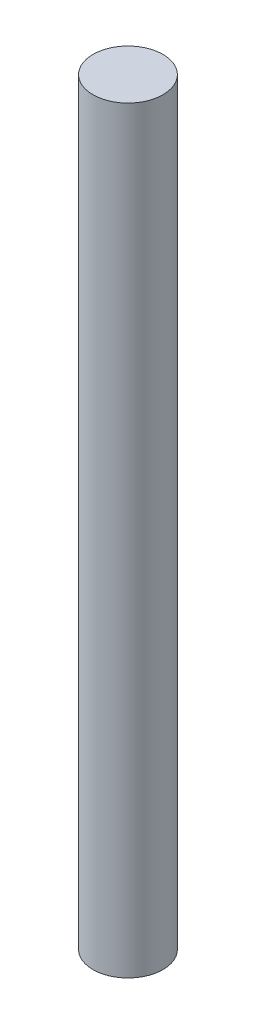
ISO-10303-21;
HEADER;
FILE_DESCRIPTION(('STEP AP214'),'2;1');
FILE_NAME('part.step','',(''),(''),'','','');
FILE_SCHEMA(('AUTOMOTIVE_DESIGN { 1 0 10303 214 1 1 1 1 }'));
ENDSEC;
DATA;
#1=APPLICATION_CONTEXT('core data for automotive mechanical design processes');
#2=APPLICATION_PROTOCOL_DEFINITION('international standard','automotive_design',2000,#1);
#3=PRODUCT_CONTEXT('',#1,'mechanical');
#4=PRODUCT('Part','Part','',(#3));
#5=PRODUCT_RELATED_PRODUCT_CATEGORY('part','',(#4));
#6=PRODUCT_DEFINITION_FORMATION('','',#4);
#7=PRODUCT_DEFINITION_CONTEXT('part definition',#1,'design');
#8=PRODUCT_DEFINITION('design','',#6,#7);
#9=PRODUCT_DEFINITION_SHAPE('','',#8);
#10=(LENGTH_UNIT() NAMED_UNIT(*) SI_UNIT(.MILLI.,.METRE.));
#11=(NAMED_UNIT(*) PLANE_ANGLE_UNIT() SI_UNIT($,.RADIAN.));
#12=(NAMED_UNIT(*) SI_UNIT($,.STERADIAN.) SOLID_ANGLE_UNIT());
#13=UNCERTAINTY_MEASURE_WITH_UNIT(LENGTH_MEASURE(1.E-05),#10,'distance_accuracy_value','');
#14=(GEOMETRIC_REPRESENTATION_CONTEXT(3) GLOBAL_UNCERTAINTY_ASSIGNED_CONTEXT((#13)) GLOBAL_UNIT_ASSIGNED_CONTEXT((#10,
#11,#12)) REPRESENTATION_CONTEXT('',''));
#15=CARTESIAN_POINT('',(0.,0.,0.));
#16=DIRECTION('',(0.,0.,1.));
#17=DIRECTION('',(1.,0.,0.));
#18=AXIS2_PLACEMENT_3D('',#15,#16,#17);
#19=CARTESIAN_POINT('',(0.,65.,0.));
#20=DIRECTION('',(0.,-1.,0.));
#21=DIRECTION('',(0.,0.,-1.));
#22=AXIS2_PLACEMENT_3D('',#19,#20,#21);
#23=CYLINDRICAL_SURFACE('',#22,3.);
#24=CARTESIAN_POINT('',(0.,65.,0.));
#25=DIRECTION('',(0.,1.,0.));
#26=DIRECTION('',(0.,0.,1.));
#27=AXIS2_PLACEMENT_3D('',#24,#25,#26);
#28=CIRCLE('',#27,3.);
#29=CARTESIAN_POINT('',(0.,65.,3.));
#30=VERTEX_POINT('',#29);
#31=EDGE_CURVE('E10',#30,#30,#28,.T.);
#32=ORIENTED_EDGE('',*,*,#31,.F.);
#33=EDGE_LOOP('',(#32));
#34=FACE_BOUND('',#33,.T.);
#35=CARTESIAN_POINT('',(0.,0.,0.));
#36=DIRECTION('',(0.,1.,0.));
#37=DIRECTION('',(0.,0.,1.));
#38=AXIS2_PLACEMENT_3D('',#35,#36,#37);
#39=CIRCLE('',#38,3.);
#40=CARTESIAN_POINT('',(0.,0.,3.));
#41=VERTEX_POINT('',#40);
#42=EDGE_CURVE('E34',#41,#41,#39,.T.);
#43=ORIENTED_EDGE('',*,*,#42,.T.);
#44=EDGE_LOOP('',(#43));
#45=FACE_BOUND('',#44,.T.);
#46=ADVANCED_FACE('F31',(#34,#45),#23,.T.);
#47=CARTESIAN_POINT('',(0.,65.,0.));
#48=DIRECTION('',(0.,1.,0.));
#49=DIRECTION('',(0.,0.,1.));
#50=AXIS2_PLACEMENT_3D('',#47,#48,#49);
#51=PLANE('',#50);
#52=ORIENTED_EDGE('',*,*,#31,.T.);
#53=EDGE_LOOP('',(#52));
#54=FACE_BOUND('',#53,.T.);
#55=ADVANCED_FACE('F46',(#54),#51,.T.);
#56=CARTESIAN_POINT('',(0.,0.,0.));
#57=DIRECTION('',(0.,1.,0.));
#58=DIRECTION('',(0.,0.,1.));
#59=AXIS2_PLACEMENT_3D('',#56,#57,#58);
#60=PLANE('',#59);
#61=ORIENTED_EDGE('',*,*,#42,.F.);
#62=EDGE_LOOP('',(#61));
#63=FACE_BOUND('',#62,.T.);
#64=ADVANCED_FACE('F44',(#63),#60,.F.);
#65=CLOSED_SHELL('',(#46,#55,#64));
#66=MANIFOLD_SOLID_BREP('B2',#65);
#67=ADVANCED_BREP_SHAPE_REPRESENTATION('',(#18,#66),#14);
#68=SHAPE_DEFINITION_REPRESENTATION(#9,#67);
ENDSEC;
END-ISO-10303-21;
